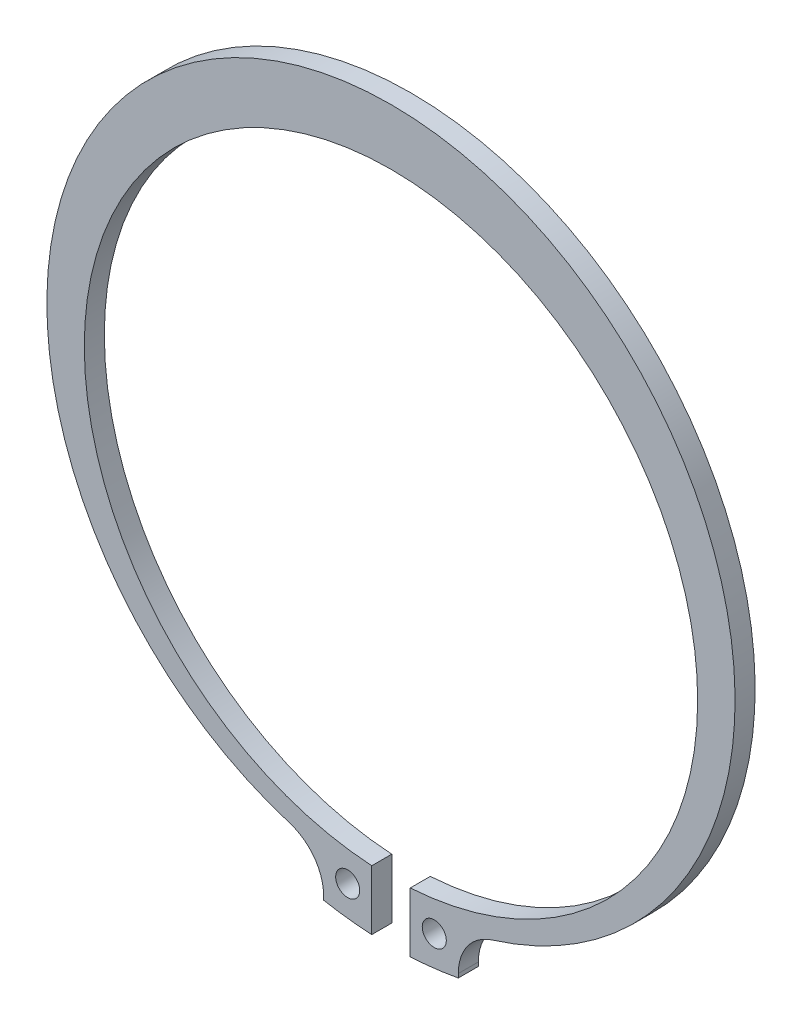
ISO-10303-21;
HEADER;
FILE_DESCRIPTION(('STEP AP214'),'2;1');
FILE_NAME('part.step','',(''),(''),'','','');
FILE_SCHEMA(('AUTOMOTIVE_DESIGN { 1 0 10303 214 1 1 1 1 }'));
ENDSEC;
DATA;
#1=APPLICATION_CONTEXT('core data for automotive mechanical design processes');
#2=APPLICATION_PROTOCOL_DEFINITION('international standard','automotive_design',2000,#1);
#3=PRODUCT_CONTEXT('',#1,'mechanical');
#4=PRODUCT('Part','Part','',(#3));
#5=PRODUCT_RELATED_PRODUCT_CATEGORY('part','',(#4));
#6=PRODUCT_DEFINITION_FORMATION('','',#4);
#7=PRODUCT_DEFINITION_CONTEXT('part definition',#1,'design');
#8=PRODUCT_DEFINITION('design','',#6,#7);
#9=PRODUCT_DEFINITION_SHAPE('','',#8);
#10=(LENGTH_UNIT() NAMED_UNIT(*) SI_UNIT(.MILLI.,.METRE.));
#11=(NAMED_UNIT(*) PLANE_ANGLE_UNIT() SI_UNIT($,.RADIAN.));
#12=(NAMED_UNIT(*) SI_UNIT($,.STERADIAN.) SOLID_ANGLE_UNIT());
#13=UNCERTAINTY_MEASURE_WITH_UNIT(LENGTH_MEASURE(1.E-05),#10,'distance_accuracy_value','');
#14=(GEOMETRIC_REPRESENTATION_CONTEXT(3) GLOBAL_UNCERTAINTY_ASSIGNED_CONTEXT((#13)) GLOBAL_UNIT_ASSIGNED_CONTEXT((#10,
#11,#12)) REPRESENTATION_CONTEXT('',''));
#15=CARTESIAN_POINT('',(0.,0.,0.));
#16=DIRECTION('',(0.,0.,1.));
#17=DIRECTION('',(1.,0.,0.));
#18=AXIS2_PLACEMENT_3D('',#15,#16,#17);
#19=CARTESIAN_POINT('',(10.8000000000016,-6.72639731256999,0.));
#20=DIRECTION('',(1.00000000000001,0.,0.));
#21=DIRECTION('',(0.,0.,-1.));
#22=AXIS2_PLACEMENT_3D('',#19,#20,#21);
#23=PLANE('',#22);
#24=DIRECTION('',(0.,0.,1.));
#25=VECTOR('',#24,1.);
#26=CARTESIAN_POINT('',(10.7999999999946,-6.72639731254088,0.));
#27=LINE('',#26,#25);
#28=CARTESIAN_POINT('',(10.7999999999974,-6.72639731254038,0.));
#29=VERTEX_POINT('',#28);
#30=CARTESIAN_POINT('',(10.7999999999974,-6.72639731254035,2.5));
#31=VERTEX_POINT('',#30);
#32=EDGE_CURVE('E95',#29,#31,#27,.T.);
#33=ORIENTED_EDGE('',*,*,#32,.F.);
#34=DIRECTION('',(0.,1.00000000000001,0.));
#35=VECTOR('',#34,1.);
#36=CARTESIAN_POINT('',(10.8000000000016,0.,0.));
#37=LINE('',#36,#35);
#38=CARTESIAN_POINT('',(10.8000000000017,-6.24115564746999,0.));
#39=VERTEX_POINT('',#38);
#40=EDGE_CURVE('E98',#29,#39,#37,.T.);
#41=ORIENTED_EDGE('',*,*,#40,.T.);
#42=DIRECTION('',(0.,0.,1.));
#43=VECTOR('',#42,1.);
#44=CARTESIAN_POINT('',(10.8000000000017,-6.24115564746999,0.));
#45=LINE('',#44,#43);
#46=CARTESIAN_POINT('',(10.8000000000017,-6.24115564746999,2.5));
#47=VERTEX_POINT('',#46);
#48=EDGE_CURVE('E118',#39,#47,#45,.T.);
#49=ORIENTED_EDGE('',*,*,#48,.T.);
#50=DIRECTION('',(0.,1.00000000000001,0.));
#51=VECTOR('',#50,1.);
#52=CARTESIAN_POINT('',(10.8000000000016,-6.72639731256999,2.5));
#53=LINE('',#52,#51);
#54=EDGE_CURVE('E100',#47,#31,#53,.F.);
#55=ORIENTED_EDGE('',*,*,#54,.T.);
#56=EDGE_LOOP('',(#33,#41,#49,#55));
#57=FACE_BOUND('',#56,.T.);
#58=ADVANCED_FACE('F16',(#57),#23,.T.);
#59=CARTESIAN_POINT('',(-5.99999999999995,-6.24115564746941,0.));
#60=DIRECTION('',(-1.00000000000001,0.,0.));
#61=DIRECTION('',(0.,0.,1.));
#62=AXIS2_PLACEMENT_3D('',#59,#60,#61);
#63=PLANE('',#62);
#64=DIRECTION('',(0.,0.,1.));
#65=VECTOR('',#64,1.);
#66=CARTESIAN_POINT('',(-5.99999999999995,-6.24115564746941,0.));
#67=LINE('',#66,#65);
#68=CARTESIAN_POINT('',(-5.99999999999995,-6.24115564746941,2.5));
#69=VERTEX_POINT('',#68);
#70=CARTESIAN_POINT('',(-5.99999999999995,-6.24115564746941,0.));
#71=VERTEX_POINT('',#70);
#72=EDGE_CURVE('E174',#69,#71,#67,.F.);
#73=ORIENTED_EDGE('',*,*,#72,.T.);
#74=DIRECTION('',(0.,1.00000000000001,0.));
#75=VECTOR('',#74,1.);
#76=CARTESIAN_POINT('',(-5.9999999999989,6.10622663543836E-13,0.));
#77=LINE('',#76,#75);
#78=CARTESIAN_POINT('',(-5.99999999999562,-6.72639731254013,0.));
#79=VERTEX_POINT('',#78);
#80=EDGE_CURVE('E114',#71,#79,#77,.F.);
#81=ORIENTED_EDGE('',*,*,#80,.T.);
#82=DIRECTION('',(0.,0.,1.));
#83=VECTOR('',#82,1.);
#84=CARTESIAN_POINT('',(-5.99999999999284,-6.72639731254066,0.));
#85=LINE('',#84,#83);
#86=CARTESIAN_POINT('',(-5.99999999999562,-6.72639731254013,2.5));
#87=VERTEX_POINT('',#86);
#88=EDGE_CURVE('E161',#87,#79,#85,.F.);
#89=ORIENTED_EDGE('',*,*,#88,.F.);
#90=DIRECTION('',(0.,1.00000000000001,0.));
#91=VECTOR('',#90,1.);
#92=CARTESIAN_POINT('',(-5.99999999999995,-6.24115564746941,2.5));
#93=LINE('',#92,#91);
#94=EDGE_CURVE('E115',#87,#69,#93,.T.);
#95=ORIENTED_EDGE('',*,*,#94,.T.);
#96=EDGE_LOOP('',(#73,#81,#89,#95));
#97=FACE_BOUND('',#96,.T.);
#98=ADVANCED_FACE('F210',(#97),#63,.T.);
#99=CARTESIAN_POINT('',(0.,0.,0.));
#100=DIRECTION('',(0.,0.,1.));
#101=DIRECTION('',(1.00000000000001,0.,0.));
#102=AXIS2_PLACEMENT_3D('',#99,#100,#101);
#103=PLANE('',#102);
#104=CARTESIAN_POINT('',(7.80000000000114,-3.44148574169029,0.));
#105=DIRECTION('',(0.,0.,-1.));
#106=DIRECTION('',(-1.00000000000001,0.,0.));
#107=AXIS2_PLACEMENT_3D('',#104,#105,#106);
#108=CIRCLE('',#107,1.5);
#109=CARTESIAN_POINT('',(6.30000000000113,-3.44148574169029,0.));
#110=VERTEX_POINT('',#109);
#111=EDGE_CURVE('E151',#110,#110,#108,.F.);
#112=ORIENTED_EDGE('',*,*,#111,.T.);
#113=EDGE_LOOP('',(#112));
#114=FACE_BOUND('',#113,.T.);
#115=CARTESIAN_POINT('',(-2.9999999999985,-3.44148574169023,0.));
#116=DIRECTION('',(0.,0.,1.));
#117=DIRECTION('',(1.00000000000001,0.,0.));
#118=AXIS2_PLACEMENT_3D('',#115,#116,#117);
#119=CIRCLE('',#118,1.5);
#120=CARTESIAN_POINT('',(-1.49999999999849,-3.44148574169023,0.));
#121=VERTEX_POINT('',#120);
#122=EDGE_CURVE('E154',#121,#121,#119,.T.);
#123=ORIENTED_EDGE('',*,*,#122,.T.);
#124=EDGE_LOOP('',(#123));
#125=FACE_BOUND('',#124,.T.);
#126=CARTESIAN_POINT('',(2.40000000000162,38.1746316288998,0.));
#127=DIRECTION('',(0.,0.,1.));
#128=DIRECTION('',(1.00000000000001,0.,0.));
#129=AXIS2_PLACEMENT_3D('',#126,#127,#128);
#130=CIRCLE('',#129,45.68);
#131=CARTESIAN_POINT('',(1.66533453693773E-12,-7.44227751673637,0.));
#132=VERTEX_POINT('',#131);
#133=EDGE_CURVE('E159',#79,#132,#130,.T.);
#134=ORIENTED_EDGE('',*,*,#133,.F.);
#135=ORIENTED_EDGE('',*,*,#80,.F.);
#136=CARTESIAN_POINT('',(-11.9999999999983,-6.24115564746966,0.));
#137=DIRECTION('',(0.,0.,1.));
#138=DIRECTION('',(1.00000000000001,0.,0.));
#139=AXIS2_PLACEMENT_3D('',#136,#137,#138);
#140=CIRCLE('',#139,6.);
#141=CARTESIAN_POINT('',(-10.2337308347746,-0.507021603346897,0.));
#142=VERTEX_POINT('',#141);
#143=EDGE_CURVE('E162',#71,#142,#140,.T.);
#144=ORIENTED_EDGE('',*,*,#143,.T.);
#145=CARTESIAN_POINT('',(2.40000000000168,40.5079649622008,0.));
#146=DIRECTION('',(0.,0.,1.));
#147=DIRECTION('',(1.00000000000001,0.,0.));
#148=AXIS2_PLACEMENT_3D('',#145,#146,#147);
#149=CIRCLE('',#148,42.9166666667);
#150=CARTESIAN_POINT('',(15.03373083478,-0.507021603364327,0.));
#151=VERTEX_POINT('',#150);
#152=EDGE_CURVE('E165',#151,#142,#149,.T.);
#153=ORIENTED_EDGE('',*,*,#152,.F.);
#154=CARTESIAN_POINT('',(16.8000000000015,-6.24115564746947,0.));
#155=DIRECTION('',(0.,0.,1.));
#156=DIRECTION('',(1.00000000000001,0.,0.));
#157=AXIS2_PLACEMENT_3D('',#154,#155,#156);
#158=CIRCLE('',#157,6.);
#159=EDGE_CURVE('E112',#151,#39,#158,.T.);
#160=ORIENTED_EDGE('',*,*,#159,.T.);
#161=ORIENTED_EDGE('',*,*,#40,.F.);
#162=CARTESIAN_POINT('',(2.40000000000162,38.1746316288998,0.));
#163=DIRECTION('',(0.,0.,1.));
#164=DIRECTION('',(1.00000000000001,0.,0.));
#165=AXIS2_PLACEMENT_3D('',#162,#163,#164);
#166=CIRCLE('',#165,45.68);
#167=CARTESIAN_POINT('',(4.80000000000091,-7.44227751672277,0.));
#168=VERTEX_POINT('',#167);
#169=EDGE_CURVE('E19',#168,#29,#166,.T.);
#170=ORIENTED_EDGE('',*,*,#169,.F.);
#171=DIRECTION('',(0.,1.00000000000001,0.));
#172=VECTOR('',#171,1.);
#173=CARTESIAN_POINT('',(4.80000000000003,3.33066907387547E-13,0.));
#174=LINE('',#173,#172);
#175=CARTESIAN_POINT('',(4.79999999999914,2.92543766988729E-11,0.));
#176=VERTEX_POINT('',#175);
#177=EDGE_CURVE('E90',#176,#168,#174,.F.);
#178=ORIENTED_EDGE('',*,*,#177,.F.);
#179=CARTESIAN_POINT('',(2.40000000000162,38.1746316288998,0.));
#180=DIRECTION('',(0.,0.,1.));
#181=DIRECTION('',(1.00000000000001,0.,0.));
#182=AXIS2_PLACEMENT_3D('',#179,#180,#181);
#183=CIRCLE('',#182,38.25);
#184=CARTESIAN_POINT('',(9.43689570931383E-13,2.92543766988729E-11,0.));
#185=VERTEX_POINT('',#184);
#186=EDGE_CURVE('E126',#176,#185,#183,.T.);
#187=ORIENTED_EDGE('',*,*,#186,.T.);
#188=DIRECTION('',(0.,1.00000000000001,0.));
#189=VECTOR('',#188,1.);
#190=CARTESIAN_POINT('',(0.,-7.44227751675,0.));
#191=LINE('',#190,#189);
#192=EDGE_CURVE('E124',#132,#185,#191,.T.);
#193=ORIENTED_EDGE('',*,*,#192,.F.);
#194=EDGE_LOOP('',(#134,#135,#144,#153,#160,#161,#170,#178,#187,#193));
#195=FACE_BOUND('',#194,.T.);
#196=ADVANCED_FACE('F109',(#114,#125,#195),#103,.F.);
#197=CARTESIAN_POINT('',(4.80000000000003,3.33066907387547E-13,0.));
#198=DIRECTION('',(-1.00000000000001,0.,0.));
#199=DIRECTION('',(0.,0.,1.));
#200=AXIS2_PLACEMENT_3D('',#197,#198,#199);
#201=PLANE('',#200);
#202=DIRECTION('',(0.,0.,1.));
#203=VECTOR('',#202,1.);
#204=CARTESIAN_POINT('',(4.79999999999819,2.88657986402541E-11,0.));
#205=LINE('',#204,#203);
#206=CARTESIAN_POINT('',(4.79999999999914,2.92543766988729E-11,2.5));
#207=VERTEX_POINT('',#206);
#208=EDGE_CURVE('E157',#207,#176,#205,.F.);
#209=ORIENTED_EDGE('',*,*,#208,.T.);
#210=ORIENTED_EDGE('',*,*,#177,.T.);
#211=DIRECTION('',(0.,0.,1.));
#212=VECTOR('',#211,1.);
#213=CARTESIAN_POINT('',(4.80000000000019,-7.44227751672283,0.));
#214=LINE('',#213,#212);
#215=CARTESIAN_POINT('',(4.80000000000091,-7.44227751672277,2.5));
#216=VERTEX_POINT('',#215);
#217=EDGE_CURVE('E105',#216,#168,#214,.F.);
#218=ORIENTED_EDGE('',*,*,#217,.F.);
#219=DIRECTION('',(0.,1.00000000000001,0.));
#220=VECTOR('',#219,1.);
#221=CARTESIAN_POINT('',(4.80000000000003,3.33066907387547E-13,2.5));
#222=LINE('',#221,#220);
#223=EDGE_CURVE('E150',#207,#216,#222,.F.);
#224=ORIENTED_EDGE('',*,*,#223,.F.);
#225=EDGE_LOOP('',(#209,#210,#218,#224));
#226=FACE_BOUND('',#225,.T.);
#227=ADVANCED_FACE('F199',(#226),#201,.T.);
#228=CARTESIAN_POINT('',(2.40000000000162,38.1746316288998,0.));
#229=DIRECTION('',(0.,0.,1.));
#230=DIRECTION('',(1.00000000000001,0.,0.));
#231=AXIS2_PLACEMENT_3D('',#228,#229,#230);
#232=CYLINDRICAL_SURFACE('',#231,45.68);
#233=ORIENTED_EDGE('',*,*,#217,.T.);
#234=ORIENTED_EDGE('',*,*,#169,.T.);
#235=ORIENTED_EDGE('',*,*,#32,.T.);
#236=CARTESIAN_POINT('',(2.40000000000162,38.1746316288998,2.5));
#237=DIRECTION('',(0.,0.,1.));
#238=DIRECTION('',(1.00000000000001,0.,0.));
#239=AXIS2_PLACEMENT_3D('',#236,#237,#238);
#240=CIRCLE('',#239,45.68);
#241=EDGE_CURVE('E148',#216,#31,#240,.T.);
#242=ORIENTED_EDGE('',*,*,#241,.F.);
#243=EDGE_LOOP('',(#233,#234,#235,#242));
#244=FACE_BOUND('',#243,.T.);
#245=ADVANCED_FACE('F117',(#244),#232,.T.);
#246=CARTESIAN_POINT('',(16.8000000000015,-6.24115564746947,0.));
#247=DIRECTION('',(0.,0.,1.));
#248=DIRECTION('',(1.00000000000001,0.,0.));
#249=AXIS2_PLACEMENT_3D('',#246,#247,#248);
#250=CYLINDRICAL_SURFACE('',#249,6.);
#251=CARTESIAN_POINT('',(16.8000000000015,-6.24115564746947,2.5));
#252=DIRECTION('',(0.,0.,1.));
#253=DIRECTION('',(1.00000000000001,0.,0.));
#254=AXIS2_PLACEMENT_3D('',#251,#252,#253);
#255=CIRCLE('',#254,6.);
#256=CARTESIAN_POINT('',(15.033730834787,-0.507021603381536,2.5));
#257=VERTEX_POINT('',#256);
#258=EDGE_CURVE('E145',#47,#257,#255,.F.);
#259=ORIENTED_EDGE('',*,*,#258,.F.);
#260=ORIENTED_EDGE('',*,*,#48,.F.);
#261=ORIENTED_EDGE('',*,*,#159,.F.);
#262=DIRECTION('',(0.,0.,1.));
#263=VECTOR('',#262,1.);
#264=CARTESIAN_POINT('',(15.0337308348071,-0.507021603374236,0.));
#265=LINE('',#264,#263);
#266=EDGE_CURVE('E167',#257,#151,#265,.F.);
#267=ORIENTED_EDGE('',*,*,#266,.F.);
#268=EDGE_LOOP('',(#259,#260,#261,#267));
#269=FACE_BOUND('',#268,.T.);
#270=ADVANCED_FACE('F202',(#269),#250,.F.);
#271=CARTESIAN_POINT('',(2.40000000000168,40.5079649622008,0.));
#272=DIRECTION('',(0.,0.,1.));
#273=DIRECTION('',(1.00000000000001,0.,0.));
#274=AXIS2_PLACEMENT_3D('',#271,#272,#273);
#275=CYLINDRICAL_SURFACE('',#274,42.9166666667);
#276=ORIENTED_EDGE('',*,*,#266,.T.);
#277=ORIENTED_EDGE('',*,*,#152,.T.);
#278=DIRECTION('',(0.,0.,1.));
#279=VECTOR('',#278,1.);
#280=CARTESIAN_POINT('',(-10.2337308347947,-0.507021603340013,0.));
#281=LINE('',#280,#279);
#282=CARTESIAN_POINT('',(-10.2337308347746,-0.507021603346897,2.5));
#283=VERTEX_POINT('',#282);
#284=EDGE_CURVE('E164',#142,#283,#281,.T.);
#285=ORIENTED_EDGE('',*,*,#284,.T.);
#286=CARTESIAN_POINT('',(2.40000000000168,40.5079649622008,2.5));
#287=DIRECTION('',(0.,0.,1.));
#288=DIRECTION('',(1.00000000000001,0.,0.));
#289=AXIS2_PLACEMENT_3D('',#286,#287,#288);
#290=CIRCLE('',#289,42.9166666667);
#291=EDGE_CURVE('E142',#257,#283,#290,.T.);
#292=ORIENTED_EDGE('',*,*,#291,.F.);
#293=EDGE_LOOP('',(#276,#277,#285,#292));
#294=FACE_BOUND('',#293,.T.);
#295=ADVANCED_FACE('F203',(#294),#275,.T.);
#296=CARTESIAN_POINT('',(-11.9999999999983,-6.24115564746966,0.));
#297=DIRECTION('',(0.,0.,1.));
#298=DIRECTION('',(1.00000000000001,0.,0.));
#299=AXIS2_PLACEMENT_3D('',#296,#297,#298);
#300=CYLINDRICAL_SURFACE('',#299,6.);
#301=CARTESIAN_POINT('',(-11.9999999999983,-6.24115564746966,2.5));
#302=DIRECTION('',(0.,0.,1.));
#303=DIRECTION('',(1.00000000000001,0.,0.));
#304=AXIS2_PLACEMENT_3D('',#301,#302,#303);
#305=CIRCLE('',#304,6.);
#306=EDGE_CURVE('E139',#283,#69,#305,.F.);
#307=ORIENTED_EDGE('',*,*,#306,.F.);
#308=ORIENTED_EDGE('',*,*,#284,.F.);
#309=ORIENTED_EDGE('',*,*,#143,.F.);
#310=ORIENTED_EDGE('',*,*,#72,.F.);
#311=EDGE_LOOP('',(#307,#308,#309,#310));
#312=FACE_BOUND('',#311,.T.);
#313=ADVANCED_FACE('F207',(#312),#300,.F.);
#314=CARTESIAN_POINT('',(2.40000000000162,38.1746316288998,0.));
#315=DIRECTION('',(0.,0.,1.));
#316=DIRECTION('',(1.00000000000001,0.,0.));
#317=AXIS2_PLACEMENT_3D('',#314,#315,#316);
#318=CYLINDRICAL_SURFACE('',#317,45.68);
#319=ORIENTED_EDGE('',*,*,#88,.T.);
#320=ORIENTED_EDGE('',*,*,#133,.T.);
#321=DIRECTION('',(0.,0.,-1.));
#322=VECTOR('',#321,1.);
#323=CARTESIAN_POINT('',(0.,-7.44227751675,0.));
#324=LINE('',#323,#322);
#325=CARTESIAN_POINT('',(1.66533453693773E-12,-7.44227751673637,2.5));
#326=VERTEX_POINT('',#325);
#327=EDGE_CURVE('E127',#326,#132,#324,.T.);
#328=ORIENTED_EDGE('',*,*,#327,.F.);
#329=CARTESIAN_POINT('',(2.40000000000162,38.1746316288998,2.5));
#330=DIRECTION('',(0.,0.,1.));
#331=DIRECTION('',(1.00000000000001,0.,0.));
#332=AXIS2_PLACEMENT_3D('',#329,#330,#331);
#333=CIRCLE('',#332,45.68);
#334=EDGE_CURVE('E136',#87,#326,#333,.T.);
#335=ORIENTED_EDGE('',*,*,#334,.F.);
#336=EDGE_LOOP('',(#319,#320,#328,#335));
#337=FACE_BOUND('',#336,.T.);
#338=ADVANCED_FACE('F193',(#337),#318,.T.);
#339=CARTESIAN_POINT('',(0.,-7.44227751675,0.));
#340=DIRECTION('',(1.00000000000001,0.,0.));
#341=DIRECTION('',(0.,0.,-1.));
#342=AXIS2_PLACEMENT_3D('',#339,#340,#341);
#343=PLANE('',#342);
#344=ORIENTED_EDGE('',*,*,#327,.T.);
#345=ORIENTED_EDGE('',*,*,#192,.T.);
#346=DIRECTION('',(0.,0.,1.));
#347=VECTOR('',#346,1.);
#348=CARTESIAN_POINT('',(1.83186799063151E-12,2.91988655476416E-11,0.));
#349=LINE('',#348,#347);
#350=CARTESIAN_POINT('',(9.43689570931383E-13,2.92543766988729E-11,2.5));
#351=VERTEX_POINT('',#350);
#352=EDGE_CURVE('E34',#185,#351,#349,.T.);
#353=ORIENTED_EDGE('',*,*,#352,.T.);
#354=DIRECTION('',(0.,1.00000000000001,0.));
#355=VECTOR('',#354,1.);
#356=CARTESIAN_POINT('',(0.,0.,2.5));
#357=LINE('',#356,#355);
#358=EDGE_CURVE('E135',#326,#351,#357,.T.);
#359=ORIENTED_EDGE('',*,*,#358,.F.);
#360=EDGE_LOOP('',(#344,#345,#353,#359));
#361=FACE_BOUND('',#360,.T.);
#362=ADVANCED_FACE('F190',(#361),#343,.T.);
#363=CARTESIAN_POINT('',(2.40000000000162,38.1746316288998,0.));
#364=DIRECTION('',(0.,0.,1.));
#365=DIRECTION('',(1.00000000000001,0.,0.));
#366=AXIS2_PLACEMENT_3D('',#363,#364,#365);
#367=CYLINDRICAL_SURFACE('',#366,38.25);
#368=CARTESIAN_POINT('',(2.40000000000162,38.1746316288998,2.5));
#369=DIRECTION('',(0.,0.,1.));
#370=DIRECTION('',(1.00000000000001,0.,0.));
#371=AXIS2_PLACEMENT_3D('',#368,#369,#370);
#372=CIRCLE('',#371,38.25);
#373=EDGE_CURVE('E132',#351,#207,#372,.F.);
#374=ORIENTED_EDGE('',*,*,#373,.F.);
#375=ORIENTED_EDGE('',*,*,#352,.F.);
#376=ORIENTED_EDGE('',*,*,#186,.F.);
#377=ORIENTED_EDGE('',*,*,#208,.F.);
#378=EDGE_LOOP('',(#374,#375,#376,#377));
#379=FACE_BOUND('',#378,.T.);
#380=ADVANCED_FACE('F198',(#379),#367,.F.);
#381=CARTESIAN_POINT('',(-2.9999999999985,-3.44148574169023,2.5));
#382=DIRECTION('',(0.,0.,1.));
#383=DIRECTION('',(1.00000000000001,0.,0.));
#384=AXIS2_PLACEMENT_3D('',#381,#382,#383);
#385=CYLINDRICAL_SURFACE('',#384,1.5);
#386=CARTESIAN_POINT('',(-2.9999999999985,-3.44148574169023,2.5));
#387=DIRECTION('',(0.,0.,1.));
#388=DIRECTION('',(1.00000000000001,0.,0.));
#389=AXIS2_PLACEMENT_3D('',#386,#387,#388);
#390=CIRCLE('',#389,1.5);
#391=CARTESIAN_POINT('',(-1.49999999999849,-3.44148574169023,2.5));
#392=VERTEX_POINT('',#391);
#393=EDGE_CURVE('E25',#392,#392,#390,.F.);
#394=ORIENTED_EDGE('',*,*,#393,.F.);
#395=EDGE_LOOP('',(#394));
#396=FACE_BOUND('',#395,.T.);
#397=ORIENTED_EDGE('',*,*,#122,.F.);
#398=EDGE_LOOP('',(#397));
#399=FACE_BOUND('',#398,.T.);
#400=ADVANCED_FACE('F226',(#396,#399),#385,.F.);
#401=CARTESIAN_POINT('',(7.80000000000114,-3.44148574169029,2.5));
#402=DIRECTION('',(0.,0.,-1.));
#403=DIRECTION('',(-1.00000000000001,0.,0.));
#404=AXIS2_PLACEMENT_3D('',#401,#402,#403);
#405=CYLINDRICAL_SURFACE('',#404,1.5);
#406=CARTESIAN_POINT('',(7.80000000000114,-3.44148574169029,2.5));
#407=DIRECTION('',(0.,0.,-1.));
#408=DIRECTION('',(-1.00000000000001,0.,0.));
#409=AXIS2_PLACEMENT_3D('',#406,#407,#408);
#410=CIRCLE('',#409,1.5);
#411=CARTESIAN_POINT('',(6.30000000000113,-3.44148574169029,2.5));
#412=VERTEX_POINT('',#411);
#413=EDGE_CURVE('E11',#412,#412,#410,.T.);
#414=ORIENTED_EDGE('',*,*,#413,.F.);
#415=EDGE_LOOP('',(#414));
#416=FACE_BOUND('',#415,.T.);
#417=ORIENTED_EDGE('',*,*,#111,.F.);
#418=EDGE_LOOP('',(#417));
#419=FACE_BOUND('',#418,.T.);
#420=ADVANCED_FACE('F220',(#416,#419),#405,.F.);
#421=CARTESIAN_POINT('',(0.,0.,2.5));
#422=DIRECTION('',(0.,0.,1.));
#423=DIRECTION('',(1.00000000000001,0.,0.));
#424=AXIS2_PLACEMENT_3D('',#421,#422,#423);
#425=PLANE('',#424);
#426=ORIENTED_EDGE('',*,*,#413,.T.);
#427=EDGE_LOOP('',(#426));
#428=FACE_BOUND('',#427,.T.);
#429=ORIENTED_EDGE('',*,*,#393,.T.);
#430=EDGE_LOOP('',(#429));
#431=FACE_BOUND('',#430,.T.);
#432=ORIENTED_EDGE('',*,*,#358,.T.);
#433=ORIENTED_EDGE('',*,*,#373,.T.);
#434=ORIENTED_EDGE('',*,*,#223,.T.);
#435=ORIENTED_EDGE('',*,*,#241,.T.);
#436=ORIENTED_EDGE('',*,*,#54,.F.);
#437=ORIENTED_EDGE('',*,*,#258,.T.);
#438=ORIENTED_EDGE('',*,*,#291,.T.);
#439=ORIENTED_EDGE('',*,*,#306,.T.);
#440=ORIENTED_EDGE('',*,*,#94,.F.);
#441=ORIENTED_EDGE('',*,*,#334,.T.);
#442=EDGE_LOOP('',(#432,#433,#434,#435,#436,#437,#438,#439,#440,#441));
#443=FACE_BOUND('',#442,.T.);
#444=ADVANCED_FACE('F188',(#428,#431,#443),#425,.T.);
#445=CLOSED_SHELL('',(#58,#98,#196,#227,#245,#270,#295,#313,#338,#362,#380,#400,#420,#444));
#446=MANIFOLD_SOLID_BREP('B1',#445);
#447=ADVANCED_BREP_SHAPE_REPRESENTATION('',(#18,#446),#14);
#448=SHAPE_DEFINITION_REPRESENTATION(#9,#447);
ENDSEC;
END-ISO-10303-21;
